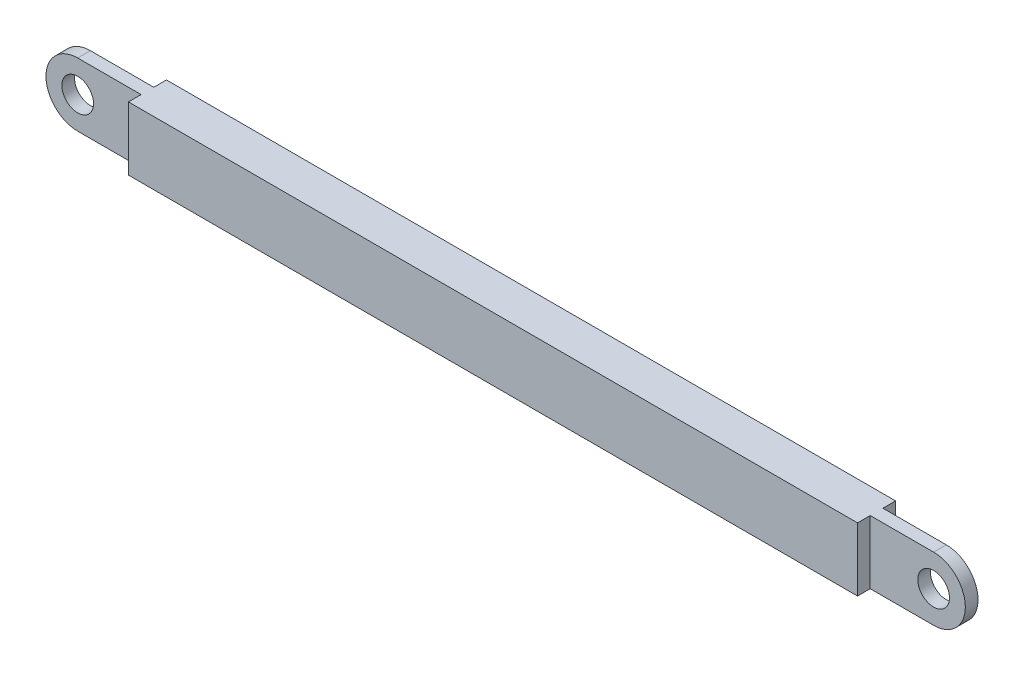
ISO-10303-21;
HEADER;
FILE_DESCRIPTION(('STEP AP214'),'2;1');
FILE_NAME('part.step','',(''),(''),'','','');
FILE_SCHEMA(('AUTOMOTIVE_DESIGN { 1 0 10303 214 1 1 1 1 }'));
ENDSEC;
DATA;
#1=APPLICATION_CONTEXT('core data for automotive mechanical design processes');
#2=APPLICATION_PROTOCOL_DEFINITION('international standard','automotive_design',2000,#1);
#3=PRODUCT_CONTEXT('',#1,'mechanical');
#4=PRODUCT('Part','Part','',(#3));
#5=PRODUCT_RELATED_PRODUCT_CATEGORY('part','',(#4));
#6=PRODUCT_DEFINITION_FORMATION('','',#4);
#7=PRODUCT_DEFINITION_CONTEXT('part definition',#1,'design');
#8=PRODUCT_DEFINITION('design','',#6,#7);
#9=PRODUCT_DEFINITION_SHAPE('','',#8);
#10=(LENGTH_UNIT() NAMED_UNIT(*) SI_UNIT(.MILLI.,.METRE.));
#11=(NAMED_UNIT(*) PLANE_ANGLE_UNIT() SI_UNIT($,.RADIAN.));
#12=(NAMED_UNIT(*) SI_UNIT($,.STERADIAN.) SOLID_ANGLE_UNIT());
#13=UNCERTAINTY_MEASURE_WITH_UNIT(LENGTH_MEASURE(1.E-05),#10,'distance_accuracy_value','');
#14=(GEOMETRIC_REPRESENTATION_CONTEXT(3) GLOBAL_UNCERTAINTY_ASSIGNED_CONTEXT((#13)) GLOBAL_UNIT_ASSIGNED_CONTEXT((#10,
#11,#12)) REPRESENTATION_CONTEXT('',''));
#15=CARTESIAN_POINT('',(0.,0.,0.));
#16=DIRECTION('',(0.,0.,1.));
#17=DIRECTION('',(1.,0.,0.));
#18=AXIS2_PLACEMENT_3D('',#15,#16,#17);
#19=CARTESIAN_POINT('',(-57.5,-5.00000000000001,3.));
#20=DIRECTION('',(-1.,0.,0.));
#21=DIRECTION('',(0.,0.,1.));
#22=AXIS2_PLACEMENT_3D('',#19,#20,#21);
#23=PLANE('',#22);
#24=DIRECTION('',(0.,0.,-1.));
#25=VECTOR('',#24,1.);
#26=CARTESIAN_POINT('',(-57.5,4.99999999999999,3.));
#27=LINE('',#26,#25);
#28=CARTESIAN_POINT('',(-57.5,4.99999999999999,3.));
#29=VERTEX_POINT('',#28);
#30=CARTESIAN_POINT('',(-57.5,5.00000000000001,1.));
#31=VERTEX_POINT('',#30);
#32=EDGE_CURVE('E138',#29,#31,#27,.T.);
#33=ORIENTED_EDGE('',*,*,#32,.T.);
#34=DIRECTION('',(0.,-1.,0.));
#35=VECTOR('',#34,1.);
#36=CARTESIAN_POINT('',(-57.5,5.00000000000001,1.));
#37=LINE('',#36,#35);
#38=CARTESIAN_POINT('',(-57.5,-5.00000000000001,1.));
#39=VERTEX_POINT('',#38);
#40=EDGE_CURVE('E125',#31,#39,#37,.T.);
#41=ORIENTED_EDGE('',*,*,#40,.T.);
#42=DIRECTION('',(0.,0.,-1.));
#43=VECTOR('',#42,1.);
#44=CARTESIAN_POINT('',(-57.5,-5.00000000000001,3.));
#45=LINE('',#44,#43);
#46=CARTESIAN_POINT('',(-57.5,-5.00000000000001,3.));
#47=VERTEX_POINT('',#46);
#48=EDGE_CURVE('E147',#47,#39,#45,.T.);
#49=ORIENTED_EDGE('',*,*,#48,.F.);
#50=DIRECTION('',(0.,1.,0.));
#51=VECTOR('',#50,1.);
#52=CARTESIAN_POINT('',(-57.5,-5.00000000000001,3.));
#53=LINE('',#52,#51);
#54=EDGE_CURVE('E145',#47,#29,#53,.T.);
#55=ORIENTED_EDGE('',*,*,#54,.T.);
#56=EDGE_LOOP('',(#33,#41,#49,#55));
#57=FACE_BOUND('',#56,.T.);
#58=ADVANCED_FACE('F37',(#57),#23,.T.);
#59=CARTESIAN_POINT('',(57.5,-4.99999999999999,3.));
#60=DIRECTION('',(-1.,0.,0.));
#61=DIRECTION('',(0.,0.,1.));
#62=AXIS2_PLACEMENT_3D('',#59,#60,#61);
#63=PLANE('',#62);
#64=DIRECTION('',(0.,-1.,0.));
#65=VECTOR('',#64,1.);
#66=CARTESIAN_POINT('',(57.5,5.00000000000001,1.));
#67=LINE('',#66,#65);
#68=CARTESIAN_POINT('',(57.5,5.00000000000001,1.));
#69=VERTEX_POINT('',#68);
#70=CARTESIAN_POINT('',(57.5,-4.99999999999999,1.));
#71=VERTEX_POINT('',#70);
#72=EDGE_CURVE('E185',#69,#71,#67,.T.);
#73=ORIENTED_EDGE('',*,*,#72,.F.);
#74=DIRECTION('',(0.,0.,-1.));
#75=VECTOR('',#74,1.);
#76=CARTESIAN_POINT('',(57.5,5.00000000000001,3.));
#77=LINE('',#76,#75);
#78=CARTESIAN_POINT('',(57.5,5.00000000000001,3.));
#79=VERTEX_POINT('',#78);
#80=EDGE_CURVE('E11',#79,#69,#77,.T.);
#81=ORIENTED_EDGE('',*,*,#80,.F.);
#82=DIRECTION('',(0.,1.,0.));
#83=VECTOR('',#82,1.);
#84=CARTESIAN_POINT('',(57.5,-4.99999999999999,3.));
#85=LINE('',#84,#83);
#86=CARTESIAN_POINT('',(57.5,-4.99999999999999,3.));
#87=VERTEX_POINT('',#86);
#88=EDGE_CURVE('E157',#87,#79,#85,.T.);
#89=ORIENTED_EDGE('',*,*,#88,.F.);
#90=DIRECTION('',(0.,0.,-1.));
#91=VECTOR('',#90,1.);
#92=CARTESIAN_POINT('',(57.5,-4.99999999999999,3.));
#93=LINE('',#92,#91);
#94=EDGE_CURVE('E151',#87,#71,#93,.T.);
#95=ORIENTED_EDGE('',*,*,#94,.T.);
#96=EDGE_LOOP('',(#73,#81,#89,#95));
#97=FACE_BOUND('',#96,.T.);
#98=ADVANCED_FACE('F272',(#97),#63,.F.);
#99=CARTESIAN_POINT('',(57.5,5.00000000000001,-1.));
#100=VERTEX_POINT('',#99);
#101=CARTESIAN_POINT('',(57.5,5.00000000000001,-3.));
#102=VERTEX_POINT('',#101);
#103=EDGE_CURVE('E45',#100,#102,#77,.T.);
#104=ORIENTED_EDGE('',*,*,#103,.F.);
#105=DIRECTION('',(0.,-1.,0.));
#106=VECTOR('',#105,1.);
#107=CARTESIAN_POINT('',(57.5,5.00000000000001,-1.));
#108=LINE('',#107,#106);
#109=CARTESIAN_POINT('',(57.5,-4.99999999999999,-1.));
#110=VERTEX_POINT('',#109);
#111=EDGE_CURVE('E60',#100,#110,#108,.T.);
#112=ORIENTED_EDGE('',*,*,#111,.T.);
#113=CARTESIAN_POINT('',(57.5,-4.99999999999999,-3.));
#114=VERTEX_POINT('',#113);
#115=EDGE_CURVE('E153',#110,#114,#93,.T.);
#116=ORIENTED_EDGE('',*,*,#115,.T.);
#117=DIRECTION('',(0.,1.,0.));
#118=VECTOR('',#117,1.);
#119=CARTESIAN_POINT('',(57.5,-4.99999999999999,-3.));
#120=LINE('',#119,#118);
#121=EDGE_CURVE('E164',#114,#102,#120,.T.);
#122=ORIENTED_EDGE('',*,*,#121,.T.);
#123=EDGE_LOOP('',(#104,#112,#116,#122));
#124=FACE_BOUND('',#123,.T.);
#125=ADVANCED_FACE('F39',(#124),#63,.F.);
#126=CARTESIAN_POINT('',(57.5,5.00000000000001,3.));
#127=DIRECTION('',(0.,-1.,0.));
#128=DIRECTION('',(1.,0.,0.));
#129=AXIS2_PLACEMENT_3D('',#126,#127,#128);
#130=PLANE('',#129);
#131=ORIENTED_EDGE('',*,*,#80,.T.);
#132=DIRECTION('',(-1.,0.,0.));
#133=VECTOR('',#132,1.);
#134=CARTESIAN_POINT('',(57.5,5.00000000000001,1.));
#135=LINE('',#134,#133);
#136=CARTESIAN_POINT('',(67.5,5.00000000000001,1.));
#137=VERTEX_POINT('',#136);
#138=EDGE_CURVE('E181',#137,#69,#135,.T.);
#139=ORIENTED_EDGE('',*,*,#138,.F.);
#140=DIRECTION('',(0.,0.,-1.));
#141=VECTOR('',#140,1.);
#142=CARTESIAN_POINT('',(67.5,5.00000000000001,1.));
#143=LINE('',#142,#141);
#144=CARTESIAN_POINT('',(67.5,5.00000000000001,-1.));
#145=VERTEX_POINT('',#144);
#146=EDGE_CURVE('E178',#137,#145,#143,.T.);
#147=ORIENTED_EDGE('',*,*,#146,.T.);
#148=DIRECTION('',(-1.,0.,0.));
#149=VECTOR('',#148,1.);
#150=CARTESIAN_POINT('',(57.5,5.00000000000001,-1.));
#151=LINE('',#150,#149);
#152=EDGE_CURVE('E182',#145,#100,#151,.T.);
#153=ORIENTED_EDGE('',*,*,#152,.T.);
#154=ORIENTED_EDGE('',*,*,#103,.T.);
#155=DIRECTION('',(-1.,0.,0.));
#156=VECTOR('',#155,1.);
#157=CARTESIAN_POINT('',(57.5,5.00000000000001,-3.));
#158=LINE('',#157,#156);
#159=CARTESIAN_POINT('',(-57.5,4.99999999999999,-3.));
#160=VERTEX_POINT('',#159);
#161=EDGE_CURVE('E161',#102,#160,#158,.T.);
#162=ORIENTED_EDGE('',*,*,#161,.T.);
#163=CARTESIAN_POINT('',(-57.5,5.00000000000001,-1.));
#164=VERTEX_POINT('',#163);
#165=EDGE_CURVE('E146',#164,#160,#27,.T.);
#166=ORIENTED_EDGE('',*,*,#165,.F.);
#167=DIRECTION('',(1.,0.,0.));
#168=VECTOR('',#167,1.);
#169=CARTESIAN_POINT('',(-57.5,5.00000000000001,-1.));
#170=LINE('',#169,#168);
#171=CARTESIAN_POINT('',(-67.5,5.00000000000001,-1.));
#172=VERTEX_POINT('',#171);
#173=EDGE_CURVE('E213',#172,#164,#170,.T.);
#174=ORIENTED_EDGE('',*,*,#173,.F.);
#175=DIRECTION('',(0.,0.,-1.));
#176=VECTOR('',#175,1.);
#177=CARTESIAN_POINT('',(-67.5,5.00000000000001,1.));
#178=LINE('',#177,#176);
#179=CARTESIAN_POINT('',(-67.5,5.00000000000001,1.));
#180=VERTEX_POINT('',#179);
#181=EDGE_CURVE('E141',#180,#172,#178,.T.);
#182=ORIENTED_EDGE('',*,*,#181,.F.);
#183=DIRECTION('',(1.,0.,0.));
#184=VECTOR('',#183,1.);
#185=CARTESIAN_POINT('',(-57.5,5.00000000000001,1.));
#186=LINE('',#185,#184);
#187=EDGE_CURVE('E128',#180,#31,#186,.T.);
#188=ORIENTED_EDGE('',*,*,#187,.T.);
#189=ORIENTED_EDGE('',*,*,#32,.F.);
#190=DIRECTION('',(-1.,0.,0.));
#191=VECTOR('',#190,1.);
#192=CARTESIAN_POINT('',(57.5,5.00000000000001,3.));
#193=LINE('',#192,#191);
#194=EDGE_CURVE('E172',#79,#29,#193,.T.);
#195=ORIENTED_EDGE('',*,*,#194,.F.);
#196=EDGE_LOOP('',(#131,#139,#147,#153,#154,#162,#166,#174,#182,#188,#189,#195));
#197=FACE_BOUND('',#196,.T.);
#198=ADVANCED_FACE('F137',(#197),#130,.F.);
#199=DIRECTION('',(0.,-1.,0.));
#200=VECTOR('',#199,1.);
#201=CARTESIAN_POINT('',(-57.5,5.00000000000001,-1.));
#202=LINE('',#201,#200);
#203=CARTESIAN_POINT('',(-57.5,-4.99999999999999,-1.));
#204=VERTEX_POINT('',#203);
#205=EDGE_CURVE('E215',#164,#204,#202,.T.);
#206=ORIENTED_EDGE('',*,*,#205,.F.);
#207=ORIENTED_EDGE('',*,*,#165,.T.);
#208=DIRECTION('',(0.,1.,0.));
#209=VECTOR('',#208,1.);
#210=CARTESIAN_POINT('',(-57.5,-5.00000000000001,-3.));
#211=LINE('',#210,#209);
#212=CARTESIAN_POINT('',(-57.5,-5.00000000000001,-3.));
#213=VERTEX_POINT('',#212);
#214=EDGE_CURVE('E158',#213,#160,#211,.T.);
#215=ORIENTED_EDGE('',*,*,#214,.F.);
#216=EDGE_CURVE('E150',#204,#213,#45,.T.);
#217=ORIENTED_EDGE('',*,*,#216,.F.);
#218=EDGE_LOOP('',(#206,#207,#215,#217));
#219=FACE_BOUND('',#218,.T.);
#220=ADVANCED_FACE('F247',(#219),#23,.T.);
#221=CARTESIAN_POINT('',(57.5,-4.99999999999999,3.));
#222=DIRECTION('',(0.,-1.,0.));
#223=DIRECTION('',(1.,0.,0.));
#224=AXIS2_PLACEMENT_3D('',#221,#222,#223);
#225=PLANE('',#224);
#226=ORIENTED_EDGE('',*,*,#115,.F.);
#227=DIRECTION('',(1.,0.,0.));
#228=VECTOR('',#227,1.);
#229=CARTESIAN_POINT('',(57.5,-4.99999999999999,-1.));
#230=LINE('',#229,#228);
#231=CARTESIAN_POINT('',(67.5,-4.99999999999999,-1.));
#232=VERTEX_POINT('',#231);
#233=EDGE_CURVE('E188',#110,#232,#230,.T.);
#234=ORIENTED_EDGE('',*,*,#233,.T.);
#235=DIRECTION('',(0.,0.,-1.));
#236=VECTOR('',#235,1.);
#237=CARTESIAN_POINT('',(67.5,-4.99999999999999,1.));
#238=LINE('',#237,#236);
#239=CARTESIAN_POINT('',(67.5,-4.99999999999999,1.));
#240=VERTEX_POINT('',#239);
#241=EDGE_CURVE('E167',#240,#232,#238,.T.);
#242=ORIENTED_EDGE('',*,*,#241,.F.);
#243=DIRECTION('',(1.,0.,0.));
#244=VECTOR('',#243,1.);
#245=CARTESIAN_POINT('',(57.5,-4.99999999999999,1.));
#246=LINE('',#245,#244);
#247=EDGE_CURVE('E196',#71,#240,#246,.T.);
#248=ORIENTED_EDGE('',*,*,#247,.F.);
#249=ORIENTED_EDGE('',*,*,#94,.F.);
#250=DIRECTION('',(-1.,0.,0.));
#251=VECTOR('',#250,1.);
#252=CARTESIAN_POINT('',(57.5,-4.99999999999999,3.));
#253=LINE('',#252,#251);
#254=EDGE_CURVE('E168',#87,#47,#253,.T.);
#255=ORIENTED_EDGE('',*,*,#254,.T.);
#256=ORIENTED_EDGE('',*,*,#48,.T.);
#257=DIRECTION('',(-1.,0.,0.));
#258=VECTOR('',#257,1.);
#259=CARTESIAN_POINT('',(-57.5,-4.99999999999999,1.));
#260=LINE('',#259,#258);
#261=CARTESIAN_POINT('',(-67.5,-4.99999999999999,1.));
#262=VERTEX_POINT('',#261);
#263=EDGE_CURVE('E52',#39,#262,#260,.T.);
#264=ORIENTED_EDGE('',*,*,#263,.T.);
#265=DIRECTION('',(0.,0.,-1.));
#266=VECTOR('',#265,1.);
#267=CARTESIAN_POINT('',(-67.5,-4.99999999999999,1.));
#268=LINE('',#267,#266);
#269=CARTESIAN_POINT('',(-67.5,-4.99999999999999,-1.));
#270=VERTEX_POINT('',#269);
#271=EDGE_CURVE('E206',#262,#270,#268,.T.);
#272=ORIENTED_EDGE('',*,*,#271,.T.);
#273=DIRECTION('',(-1.,0.,0.));
#274=VECTOR('',#273,1.);
#275=CARTESIAN_POINT('',(-57.5,-4.99999999999999,-1.));
#276=LINE('',#275,#274);
#277=EDGE_CURVE('E133',#204,#270,#276,.T.);
#278=ORIENTED_EDGE('',*,*,#277,.F.);
#279=ORIENTED_EDGE('',*,*,#216,.T.);
#280=DIRECTION('',(-1.,0.,0.));
#281=VECTOR('',#280,1.);
#282=CARTESIAN_POINT('',(57.5,-4.99999999999999,-3.));
#283=LINE('',#282,#281);
#284=EDGE_CURVE('E154',#114,#213,#283,.T.);
#285=ORIENTED_EDGE('',*,*,#284,.F.);
#286=EDGE_LOOP('',(#226,#234,#242,#248,#249,#255,#256,#264,#272,#278,#279,#285));
#287=FACE_BOUND('',#286,.T.);
#288=ADVANCED_FACE('F243',(#287),#225,.T.);
#289=CARTESIAN_POINT('',(0.,0.,3.));
#290=DIRECTION('',(0.,0.,1.));
#291=DIRECTION('',(1.,0.,0.));
#292=AXIS2_PLACEMENT_3D('',#289,#290,#291);
#293=PLANE('',#292);
#294=ORIENTED_EDGE('',*,*,#88,.T.);
#295=ORIENTED_EDGE('',*,*,#194,.T.);
#296=ORIENTED_EDGE('',*,*,#54,.F.);
#297=ORIENTED_EDGE('',*,*,#254,.F.);
#298=EDGE_LOOP('',(#294,#295,#296,#297));
#299=FACE_BOUND('',#298,.T.);
#300=ADVANCED_FACE('F274',(#299),#293,.T.);
#301=CARTESIAN_POINT('',(0.,0.,-3.));
#302=DIRECTION('',(0.,0.,1.));
#303=DIRECTION('',(1.,0.,0.));
#304=AXIS2_PLACEMENT_3D('',#301,#302,#303);
#305=PLANE('',#304);
#306=ORIENTED_EDGE('',*,*,#121,.F.);
#307=ORIENTED_EDGE('',*,*,#284,.T.);
#308=ORIENTED_EDGE('',*,*,#214,.T.);
#309=ORIENTED_EDGE('',*,*,#161,.F.);
#310=EDGE_LOOP('',(#306,#307,#308,#309));
#311=FACE_BOUND('',#310,.T.);
#312=ADVANCED_FACE('F251',(#311),#305,.F.);
#313=CARTESIAN_POINT('',(67.5,0.,1.));
#314=DIRECTION('',(0.,0.,-1.));
#315=DIRECTION('',(-1.,0.,0.));
#316=AXIS2_PLACEMENT_3D('',#313,#314,#315);
#317=PLANE('',#316);
#318=ORIENTED_EDGE('',*,*,#72,.T.);
#319=ORIENTED_EDGE('',*,*,#247,.T.);
#320=CARTESIAN_POINT('',(67.5,0.,1.));
#321=DIRECTION('',(0.,0.,1.));
#322=DIRECTION('',(-1.,0.,0.));
#323=AXIS2_PLACEMENT_3D('',#320,#321,#322);
#324=CIRCLE('',#323,5.);
#325=EDGE_CURVE('E194',#240,#137,#324,.T.);
#326=ORIENTED_EDGE('',*,*,#325,.T.);
#327=ORIENTED_EDGE('',*,*,#138,.T.);
#328=EDGE_LOOP('',(#318,#319,#326,#327));
#329=FACE_BOUND('',#328,.T.);
#330=CARTESIAN_POINT('',(67.5,0.,1.));
#331=DIRECTION('',(0.,0.,1.));
#332=DIRECTION('',(1.,0.,0.));
#333=AXIS2_PLACEMENT_3D('',#330,#331,#332);
#334=CIRCLE('',#333,2.5);
#335=CARTESIAN_POINT('',(70.,0.,1.));
#336=VERTEX_POINT('',#335);
#337=EDGE_CURVE('E191',#336,#336,#334,.T.);
#338=ORIENTED_EDGE('',*,*,#337,.F.);
#339=EDGE_LOOP('',(#338));
#340=FACE_BOUND('',#339,.T.);
#341=ADVANCED_FACE('F266',(#329,#340),#317,.F.);
#342=CARTESIAN_POINT('',(67.5,0.,-1.));
#343=DIRECTION('',(0.,0.,-1.));
#344=DIRECTION('',(-1.,0.,0.));
#345=AXIS2_PLACEMENT_3D('',#342,#343,#344);
#346=PLANE('',#345);
#347=ORIENTED_EDGE('',*,*,#111,.F.);
#348=ORIENTED_EDGE('',*,*,#152,.F.);
#349=CARTESIAN_POINT('',(67.5,0.,-1.));
#350=DIRECTION('',(0.,0.,1.));
#351=DIRECTION('',(-1.,0.,0.));
#352=AXIS2_PLACEMENT_3D('',#349,#350,#351);
#353=CIRCLE('',#352,5.);
#354=EDGE_CURVE('E186',#232,#145,#353,.T.);
#355=ORIENTED_EDGE('',*,*,#354,.F.);
#356=ORIENTED_EDGE('',*,*,#233,.F.);
#357=EDGE_LOOP('',(#347,#348,#355,#356));
#358=FACE_BOUND('',#357,.T.);
#359=CARTESIAN_POINT('',(67.5,0.,-1.));
#360=DIRECTION('',(0.,0.,1.));
#361=DIRECTION('',(1.,0.,0.));
#362=AXIS2_PLACEMENT_3D('',#359,#360,#361);
#363=CIRCLE('',#362,2.5);
#364=CARTESIAN_POINT('',(70.,0.,-1.));
#365=VERTEX_POINT('',#364);
#366=EDGE_CURVE('E200',#365,#365,#363,.T.);
#367=ORIENTED_EDGE('',*,*,#366,.T.);
#368=EDGE_LOOP('',(#367));
#369=FACE_BOUND('',#368,.T.);
#370=ADVANCED_FACE('F256',(#358,#369),#346,.T.);
#371=CARTESIAN_POINT('',(67.5,0.,1.));
#372=DIRECTION('',(0.,0.,-1.));
#373=DIRECTION('',(-1.,0.,0.));
#374=AXIS2_PLACEMENT_3D('',#371,#372,#373);
#375=CYLINDRICAL_SURFACE('',#374,5.);
#376=ORIENTED_EDGE('',*,*,#354,.T.);
#377=ORIENTED_EDGE('',*,*,#146,.F.);
#378=ORIENTED_EDGE('',*,*,#325,.F.);
#379=ORIENTED_EDGE('',*,*,#241,.T.);
#380=EDGE_LOOP('',(#376,#377,#378,#379));
#381=FACE_BOUND('',#380,.T.);
#382=ADVANCED_FACE('F261',(#381),#375,.T.);
#383=CARTESIAN_POINT('',(67.5,0.,1.));
#384=DIRECTION('',(0.,0.,-1.));
#385=DIRECTION('',(-1.,0.,0.));
#386=AXIS2_PLACEMENT_3D('',#383,#384,#385);
#387=CYLINDRICAL_SURFACE('',#386,2.5);
#388=ORIENTED_EDGE('',*,*,#337,.T.);
#389=EDGE_LOOP('',(#388));
#390=FACE_BOUND('',#389,.T.);
#391=ORIENTED_EDGE('',*,*,#366,.F.);
#392=EDGE_LOOP('',(#391));
#393=FACE_BOUND('',#392,.T.);
#394=ADVANCED_FACE('F301',(#390,#393),#387,.F.);
#395=CARTESIAN_POINT('',(-67.5,0.,1.));
#396=DIRECTION('',(0.,0.,-1.));
#397=DIRECTION('',(-1.,0.,0.));
#398=AXIS2_PLACEMENT_3D('',#395,#396,#397);
#399=CYLINDRICAL_SURFACE('',#398,5.);
#400=CARTESIAN_POINT('',(-67.5,0.,-1.));
#401=DIRECTION('',(0.,0.,-1.));
#402=DIRECTION('',(1.,0.,0.));
#403=AXIS2_PLACEMENT_3D('',#400,#401,#402);
#404=CIRCLE('',#403,5.);
#405=EDGE_CURVE('E210',#270,#172,#404,.T.);
#406=ORIENTED_EDGE('',*,*,#405,.F.);
#407=ORIENTED_EDGE('',*,*,#271,.F.);
#408=CARTESIAN_POINT('',(-67.5,0.,1.));
#409=DIRECTION('',(0.,0.,-1.));
#410=DIRECTION('',(1.,0.,0.));
#411=AXIS2_PLACEMENT_3D('',#408,#409,#410);
#412=CIRCLE('',#411,5.);
#413=EDGE_CURVE('E142',#262,#180,#412,.T.);
#414=ORIENTED_EDGE('',*,*,#413,.T.);
#415=ORIENTED_EDGE('',*,*,#181,.T.);
#416=EDGE_LOOP('',(#406,#407,#414,#415));
#417=FACE_BOUND('',#416,.T.);
#418=ADVANCED_FACE('F299',(#417),#399,.T.);
#419=CARTESIAN_POINT('',(-67.5,0.,1.));
#420=DIRECTION('',(0.,0.,-1.));
#421=DIRECTION('',(1.,0.,0.));
#422=AXIS2_PLACEMENT_3D('',#419,#420,#421);
#423=PLANE('',#422);
#424=CARTESIAN_POINT('',(-67.5,0.,1.));
#425=DIRECTION('',(0.,0.,-1.));
#426=DIRECTION('',(-1.,0.,0.));
#427=AXIS2_PLACEMENT_3D('',#424,#425,#426);
#428=CIRCLE('',#427,2.5);
#429=CARTESIAN_POINT('',(-70.,0.,1.));
#430=VERTEX_POINT('',#429);
#431=EDGE_CURVE('E217',#430,#430,#428,.T.);
#432=ORIENTED_EDGE('',*,*,#431,.T.);
#433=EDGE_LOOP('',(#432));
#434=FACE_BOUND('',#433,.T.);
#435=ORIENTED_EDGE('',*,*,#40,.F.);
#436=ORIENTED_EDGE('',*,*,#187,.F.);
#437=ORIENTED_EDGE('',*,*,#413,.F.);
#438=ORIENTED_EDGE('',*,*,#263,.F.);
#439=EDGE_LOOP('',(#435,#436,#437,#438));
#440=FACE_BOUND('',#439,.T.);
#441=ADVANCED_FACE('F127',(#434,#440),#423,.F.);
#442=CARTESIAN_POINT('',(-67.5,0.,-1.));
#443=DIRECTION('',(0.,0.,-1.));
#444=DIRECTION('',(1.,0.,0.));
#445=AXIS2_PLACEMENT_3D('',#442,#443,#444);
#446=PLANE('',#445);
#447=CARTESIAN_POINT('',(-67.5,0.,-1.));
#448=DIRECTION('',(0.,0.,-1.));
#449=DIRECTION('',(-1.,0.,0.));
#450=AXIS2_PLACEMENT_3D('',#447,#448,#449);
#451=CIRCLE('',#450,2.5);
#452=CARTESIAN_POINT('',(-70.,0.,-1.));
#453=VERTEX_POINT('',#452);
#454=EDGE_CURVE('E220',#453,#453,#451,.T.);
#455=ORIENTED_EDGE('',*,*,#454,.F.);
#456=EDGE_LOOP('',(#455));
#457=FACE_BOUND('',#456,.T.);
#458=ORIENTED_EDGE('',*,*,#205,.T.);
#459=ORIENTED_EDGE('',*,*,#277,.T.);
#460=ORIENTED_EDGE('',*,*,#405,.T.);
#461=ORIENTED_EDGE('',*,*,#173,.T.);
#462=EDGE_LOOP('',(#458,#459,#460,#461));
#463=FACE_BOUND('',#462,.T.);
#464=ADVANCED_FACE('F230',(#457,#463),#446,.T.);
#465=CARTESIAN_POINT('',(-67.5,0.,1.));
#466=DIRECTION('',(0.,0.,-1.));
#467=DIRECTION('',(-1.,0.,0.));
#468=AXIS2_PLACEMENT_3D('',#465,#466,#467);
#469=CYLINDRICAL_SURFACE('',#468,2.5);
#470=ORIENTED_EDGE('',*,*,#431,.F.);
#471=EDGE_LOOP('',(#470));
#472=FACE_BOUND('',#471,.T.);
#473=ORIENTED_EDGE('',*,*,#454,.T.);
#474=EDGE_LOOP('',(#473));
#475=FACE_BOUND('',#474,.T.);
#476=ADVANCED_FACE('F227',(#472,#475),#469,.F.);
#477=CLOSED_SHELL('',(#58,#98,#125,#198,#220,#288,#300,#312,#341,#370,#382,#394,#418,#441,#464,#476));
#478=MANIFOLD_SOLID_BREP('B2',#477);
#479=ADVANCED_BREP_SHAPE_REPRESENTATION('',(#18,#478),#14);
#480=SHAPE_DEFINITION_REPRESENTATION(#9,#479);
ENDSEC;
END-ISO-10303-21;
